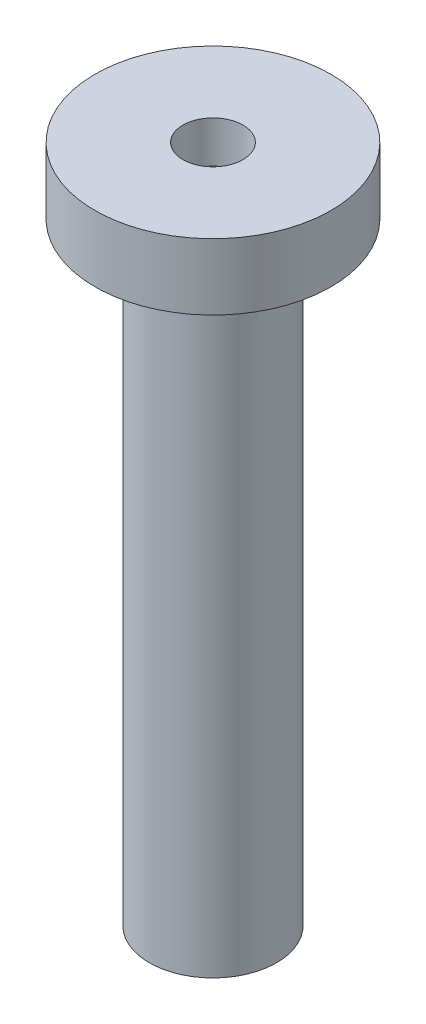
ISO-10303-21;
HEADER;
FILE_DESCRIPTION(('STEP AP214'),'2;1');
FILE_NAME('part.step','',(''),(''),'','','');
FILE_SCHEMA(('AUTOMOTIVE_DESIGN { 1 0 10303 214 1 1 1 1 }'));
ENDSEC;
DATA;
#1=APPLICATION_CONTEXT('core data for automotive mechanical design processes');
#2=APPLICATION_PROTOCOL_DEFINITION('international standard','automotive_design',2000,#1);
#3=PRODUCT_CONTEXT('',#1,'mechanical');
#4=PRODUCT('Part','Part','',(#3));
#5=PRODUCT_RELATED_PRODUCT_CATEGORY('part','',(#4));
#6=PRODUCT_DEFINITION_FORMATION('','',#4);
#7=PRODUCT_DEFINITION_CONTEXT('part definition',#1,'design');
#8=PRODUCT_DEFINITION('design','',#6,#7);
#9=PRODUCT_DEFINITION_SHAPE('','',#8);
#10=(LENGTH_UNIT() NAMED_UNIT(*) SI_UNIT(.MILLI.,.METRE.));
#11=(NAMED_UNIT(*) PLANE_ANGLE_UNIT() SI_UNIT($,.RADIAN.));
#12=(NAMED_UNIT(*) SI_UNIT($,.STERADIAN.) SOLID_ANGLE_UNIT());
#13=UNCERTAINTY_MEASURE_WITH_UNIT(LENGTH_MEASURE(1.E-05),#10,'distance_accuracy_value','');
#14=(GEOMETRIC_REPRESENTATION_CONTEXT(3) GLOBAL_UNCERTAINTY_ASSIGNED_CONTEXT((#13)) GLOBAL_UNIT_ASSIGNED_CONTEXT((#10,
#11,#12)) REPRESENTATION_CONTEXT('',''));
#15=CARTESIAN_POINT('',(0.,0.,0.));
#16=DIRECTION('',(0.,0.,1.));
#17=DIRECTION('',(1.,0.,0.));
#18=AXIS2_PLACEMENT_3D('',#15,#16,#17);
#19=CARTESIAN_POINT('',(0.,0.,0.));
#20=DIRECTION('',(0.,-1.,0.));
#21=DIRECTION('',(0.,0.,-1.));
#22=AXIS2_PLACEMENT_3D('',#19,#20,#21);
#23=PLANE('',#22);
#24=CARTESIAN_POINT('',(0.,0.,0.));
#25=DIRECTION('',(0.,-1.,0.));
#26=DIRECTION('',(0.,0.,-1.));
#27=AXIS2_PLACEMENT_3D('',#24,#25,#26);
#28=CIRCLE('',#27,1.3);
#29=CARTESIAN_POINT('',(0.,0.,-1.3));
#30=VERTEX_POINT('',#29);
#31=EDGE_CURVE('E11',#30,#30,#28,.T.);
#32=ORIENTED_EDGE('',*,*,#31,.T.);
#33=EDGE_LOOP('',(#32));
#34=FACE_BOUND('',#33,.T.);
#35=ADVANCED_FACE('F39',(#34),#23,.T.);
#36=CARTESIAN_POINT('',(0.,0.,0.));
#37=DIRECTION('',(0.,-1.,0.));
#38=DIRECTION('',(0.,0.,-1.));
#39=AXIS2_PLACEMENT_3D('',#36,#37,#38);
#40=CYLINDRICAL_SURFACE('',#39,1.3);
#41=CARTESIAN_POINT('',(0.,12.5,0.));
#42=DIRECTION('',(0.,-1.,0.));
#43=DIRECTION('',(0.,0.,-1.));
#44=AXIS2_PLACEMENT_3D('',#41,#42,#43);
#45=CIRCLE('',#44,1.3);
#46=CARTESIAN_POINT('',(0.,12.5,-1.3));
#47=VERTEX_POINT('',#46);
#48=EDGE_CURVE('E46',#47,#47,#45,.T.);
#49=ORIENTED_EDGE('',*,*,#48,.T.);
#50=EDGE_LOOP('',(#49));
#51=FACE_BOUND('',#50,.T.);
#52=ORIENTED_EDGE('',*,*,#31,.F.);
#53=EDGE_LOOP('',(#52));
#54=FACE_BOUND('',#53,.T.);
#55=ADVANCED_FACE('F76',(#51,#54),#40,.T.);
#56=CARTESIAN_POINT('',(1.3,12.5,0.));
#57=DIRECTION('',(0.,-1.,0.));
#58=DIRECTION('',(0.,0.,-1.));
#59=AXIS2_PLACEMENT_3D('',#56,#57,#58);
#60=PLANE('',#59);
#61=CARTESIAN_POINT('',(0.,12.5,0.));
#62=DIRECTION('',(0.,-1.,0.));
#63=DIRECTION('',(0.,0.,-1.));
#64=AXIS2_PLACEMENT_3D('',#61,#62,#63);
#65=CIRCLE('',#64,2.40860915136148);
#66=CARTESIAN_POINT('',(0.,12.5,-2.40860915136148));
#67=VERTEX_POINT('',#66);
#68=EDGE_CURVE('E69',#67,#67,#65,.T.);
#69=ORIENTED_EDGE('',*,*,#68,.T.);
#70=EDGE_LOOP('',(#69));
#71=FACE_BOUND('',#70,.T.);
#72=ORIENTED_EDGE('',*,*,#48,.F.);
#73=EDGE_LOOP('',(#72));
#74=FACE_BOUND('',#73,.T.);
#75=ADVANCED_FACE('F79',(#71,#74),#60,.T.);
#76=CARTESIAN_POINT('',(0.,0.,0.));
#77=DIRECTION('',(0.,-1.,0.));
#78=DIRECTION('',(0.,0.,-1.));
#79=AXIS2_PLACEMENT_3D('',#76,#77,#78);
#80=CYLINDRICAL_SURFACE('',#79,2.40860915136148);
#81=CARTESIAN_POINT('',(0.,13.8500232967467,0.));
#82=DIRECTION('',(0.,-1.,0.));
#83=DIRECTION('',(0.,0.,-1.));
#84=AXIS2_PLACEMENT_3D('',#81,#82,#83);
#85=CIRCLE('',#84,2.40860915136148);
#86=CARTESIAN_POINT('',(0.,13.8500232967467,-2.40860915136148));
#87=VERTEX_POINT('',#86);
#88=EDGE_CURVE('E63',#87,#87,#85,.T.);
#89=ORIENTED_EDGE('',*,*,#88,.T.);
#90=EDGE_LOOP('',(#89));
#91=FACE_BOUND('',#90,.T.);
#92=ORIENTED_EDGE('',*,*,#68,.F.);
#93=EDGE_LOOP('',(#92));
#94=FACE_BOUND('',#93,.T.);
#95=ADVANCED_FACE('F81',(#91,#94),#80,.T.);
#96=CARTESIAN_POINT('',(2.40860915136148,13.8500232967467,0.));
#97=DIRECTION('',(0.,1.,0.));
#98=DIRECTION('',(0.,0.,1.));
#99=AXIS2_PLACEMENT_3D('',#96,#97,#98);
#100=PLANE('',#99);
#101=CARTESIAN_POINT('',(0.,13.8500232967467,0.));
#102=DIRECTION('',(0.,-1.,0.));
#103=DIRECTION('',(0.,0.,-1.));
#104=AXIS2_PLACEMENT_3D('',#101,#102,#103);
#105=CIRCLE('',#104,0.612219446710561);
#106=CARTESIAN_POINT('',(0.,13.8500232967467,-0.612219446710561));
#107=VERTEX_POINT('',#106);
#108=EDGE_CURVE('E59',#107,#107,#105,.T.);
#109=ORIENTED_EDGE('',*,*,#108,.T.);
#110=EDGE_LOOP('',(#109));
#111=FACE_BOUND('',#110,.T.);
#112=ORIENTED_EDGE('',*,*,#88,.F.);
#113=EDGE_LOOP('',(#112));
#114=FACE_BOUND('',#113,.T.);
#115=ADVANCED_FACE('F88',(#111,#114),#100,.T.);
#116=CARTESIAN_POINT('',(0.,0.,0.));
#117=DIRECTION('',(0.,-1.,0.));
#118=DIRECTION('',(0.,0.,-1.));
#119=AXIS2_PLACEMENT_3D('',#116,#117,#118);
#120=CYLINDRICAL_SURFACE('',#119,0.612219446710561);
#121=CARTESIAN_POINT('',(0.,12.9975566709983,0.));
#122=DIRECTION('',(0.,-1.,0.));
#123=DIRECTION('',(0.,0.,-1.));
#124=AXIS2_PLACEMENT_3D('',#121,#122,#123);
#125=CIRCLE('',#124,0.612219446710561);
#126=CARTESIAN_POINT('',(0.,12.9975566709983,-0.612219446710561));
#127=VERTEX_POINT('',#126);
#128=EDGE_CURVE('E56',#127,#127,#125,.T.);
#129=ORIENTED_EDGE('',*,*,#128,.T.);
#130=EDGE_LOOP('',(#129));
#131=FACE_BOUND('',#130,.T.);
#132=ORIENTED_EDGE('',*,*,#108,.F.);
#133=EDGE_LOOP('',(#132));
#134=FACE_BOUND('',#133,.T.);
#135=ADVANCED_FACE('F52',(#131,#134),#120,.F.);
#136=CARTESIAN_POINT('',(0.,12.9975566709983,0.));
#137=DIRECTION('',(0.,1.,0.));
#138=DIRECTION('',(0.,0.,1.));
#139=AXIS2_PLACEMENT_3D('',#136,#137,#138);
#140=CONICAL_SURFACE('',#139,0.612219446710561,0.888353483149556);
#141=CARTESIAN_POINT('',(0.,12.5,0.));
#142=VERTEX_POINT('',#141);
#143=VERTEX_LOOP('',#142);
#144=FACE_BOUND('',#143,.T.);
#145=ORIENTED_EDGE('',*,*,#128,.F.);
#146=EDGE_LOOP('',(#145));
#147=FACE_BOUND('',#146,.T.);
#148=ADVANCED_FACE('F49',(#144,#147),#140,.F.);
#149=CLOSED_SHELL('',(#35,#55,#75,#95,#115,#135,#148));
#150=MANIFOLD_SOLID_BREP('B2',#149);
#151=ADVANCED_BREP_SHAPE_REPRESENTATION('',(#18,#150),#14);
#152=SHAPE_DEFINITION_REPRESENTATION(#9,#151);
ENDSEC;
END-ISO-10303-21;
